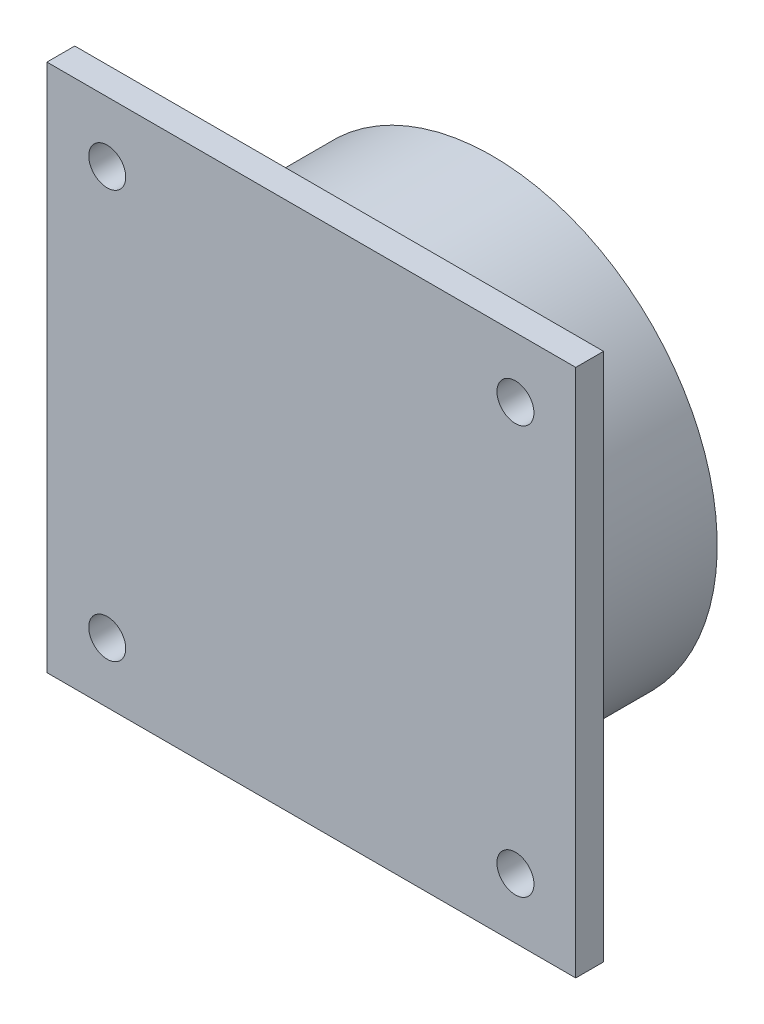
ISO-10303-21;
HEADER;
FILE_DESCRIPTION(('STEP AP214'),'2;1');
FILE_NAME('part.step','',(''),(''),'','','');
FILE_SCHEMA(('AUTOMOTIVE_DESIGN { 1 0 10303 214 1 1 1 1 }'));
ENDSEC;
DATA;
#1=APPLICATION_CONTEXT('core data for automotive mechanical design processes');
#2=APPLICATION_PROTOCOL_DEFINITION('international standard','automotive_design',2000,#1);
#3=PRODUCT_CONTEXT('',#1,'mechanical');
#4=PRODUCT('Part','Part','',(#3));
#5=PRODUCT_RELATED_PRODUCT_CATEGORY('part','',(#4));
#6=PRODUCT_DEFINITION_FORMATION('','',#4);
#7=PRODUCT_DEFINITION_CONTEXT('part definition',#1,'design');
#8=PRODUCT_DEFINITION('design','',#6,#7);
#9=PRODUCT_DEFINITION_SHAPE('','',#8);
#10=(LENGTH_UNIT() NAMED_UNIT(*) SI_UNIT(.MILLI.,.METRE.));
#11=(NAMED_UNIT(*) PLANE_ANGLE_UNIT() SI_UNIT($,.RADIAN.));
#12=(NAMED_UNIT(*) SI_UNIT($,.STERADIAN.) SOLID_ANGLE_UNIT());
#13=UNCERTAINTY_MEASURE_WITH_UNIT(LENGTH_MEASURE(1.E-05),#10,'distance_accuracy_value','');
#14=(GEOMETRIC_REPRESENTATION_CONTEXT(3) GLOBAL_UNCERTAINTY_ASSIGNED_CONTEXT((#13)) GLOBAL_UNIT_ASSIGNED_CONTEXT((#10,
#11,#12)) REPRESENTATION_CONTEXT('',''));
#15=CARTESIAN_POINT('',(0.,0.,0.));
#16=DIRECTION('',(0.,0.,1.));
#17=DIRECTION('',(1.,0.,0.));
#18=AXIS2_PLACEMENT_3D('',#15,#16,#17);
#19=CARTESIAN_POINT('',(-13.908,32.946,3.));
#20=DIRECTION('',(1.,0.,0.));
#21=DIRECTION('',(0.,1.,0.));
#22=AXIS2_PLACEMENT_3D('',#19,#20,#21);
#23=PLANE('',#22);
#24=DIRECTION('',(0.,-1.,0.));
#25=VECTOR('',#24,1.);
#26=CARTESIAN_POINT('',(-13.908,32.946,0.));
#27=LINE('',#26,#25);
#28=CARTESIAN_POINT('',(-13.908,32.946,0.));
#29=VERTEX_POINT('',#28);
#30=CARTESIAN_POINT('',(-13.908,-24.054,0.));
#31=VERTEX_POINT('',#30);
#32=EDGE_CURVE('E115',#29,#31,#27,.T.);
#33=ORIENTED_EDGE('',*,*,#32,.T.);
#34=DIRECTION('',(0.,0.,-1.));
#35=VECTOR('',#34,1.);
#36=CARTESIAN_POINT('',(-13.908,-24.054,3.));
#37=LINE('',#36,#35);
#38=CARTESIAN_POINT('',(-13.908,-24.054,3.));
#39=VERTEX_POINT('',#38);
#40=EDGE_CURVE('E56',#39,#31,#37,.T.);
#41=ORIENTED_EDGE('',*,*,#40,.F.);
#42=DIRECTION('',(0.,-1.,0.));
#43=VECTOR('',#42,1.);
#44=CARTESIAN_POINT('',(-13.908,32.946,3.));
#45=LINE('',#44,#43);
#46=CARTESIAN_POINT('',(-13.908,32.946,3.));
#47=VERTEX_POINT('',#46);
#48=EDGE_CURVE('E101',#47,#39,#45,.T.);
#49=ORIENTED_EDGE('',*,*,#48,.F.);
#50=DIRECTION('',(0.,0.,-1.));
#51=VECTOR('',#50,1.);
#52=CARTESIAN_POINT('',(-13.908,32.946,3.));
#53=LINE('',#52,#51);
#54=EDGE_CURVE('E111',#47,#29,#53,.T.);
#55=ORIENTED_EDGE('',*,*,#54,.T.);
#56=EDGE_LOOP('',(#33,#41,#49,#55));
#57=FACE_BOUND('',#56,.T.);
#58=ADVANCED_FACE('F47',(#57),#23,.F.);
#59=CARTESIAN_POINT('',(-13.908,-24.054,3.));
#60=DIRECTION('',(0.,1.,0.));
#61=DIRECTION('',(0.,0.,1.));
#62=AXIS2_PLACEMENT_3D('',#59,#60,#61);
#63=PLANE('',#62);
#64=DIRECTION('',(1.,0.,0.));
#65=VECTOR('',#64,1.);
#66=CARTESIAN_POINT('',(-13.908,-24.054,0.));
#67=LINE('',#66,#65);
#68=CARTESIAN_POINT('',(43.092,-24.054,0.));
#69=VERTEX_POINT('',#68);
#70=EDGE_CURVE('E106',#31,#69,#67,.T.);
#71=ORIENTED_EDGE('',*,*,#70,.T.);
#72=DIRECTION('',(0.,0.,-1.));
#73=VECTOR('',#72,1.);
#74=CARTESIAN_POINT('',(43.092,-24.054,3.));
#75=LINE('',#74,#73);
#76=CARTESIAN_POINT('',(43.092,-24.054,3.));
#77=VERTEX_POINT('',#76);
#78=EDGE_CURVE('E104',#77,#69,#75,.T.);
#79=ORIENTED_EDGE('',*,*,#78,.F.);
#80=DIRECTION('',(1.,0.,0.));
#81=VECTOR('',#80,1.);
#82=CARTESIAN_POINT('',(-13.908,-24.054,3.));
#83=LINE('',#82,#81);
#84=EDGE_CURVE('E96',#39,#77,#83,.T.);
#85=ORIENTED_EDGE('',*,*,#84,.F.);
#86=ORIENTED_EDGE('',*,*,#40,.T.);
#87=EDGE_LOOP('',(#71,#79,#85,#86));
#88=FACE_BOUND('',#87,.T.);
#89=ADVANCED_FACE('F105',(#88),#63,.F.);
#90=CARTESIAN_POINT('',(43.092,32.946,3.));
#91=DIRECTION('',(-1.,0.,0.));
#92=DIRECTION('',(0.,-1.,0.));
#93=AXIS2_PLACEMENT_3D('',#90,#91,#92);
#94=PLANE('',#93);
#95=DIRECTION('',(0.,1.,0.));
#96=VECTOR('',#95,1.);
#97=CARTESIAN_POINT('',(43.092,32.946,0.));
#98=LINE('',#97,#96);
#99=CARTESIAN_POINT('',(43.092,32.946,0.));
#100=VERTEX_POINT('',#99);
#101=EDGE_CURVE('E82',#69,#100,#98,.T.);
#102=ORIENTED_EDGE('',*,*,#101,.T.);
#103=DIRECTION('',(0.,0.,-1.));
#104=VECTOR('',#103,1.);
#105=CARTESIAN_POINT('',(43.092,32.946,3.));
#106=LINE('',#105,#104);
#107=CARTESIAN_POINT('',(43.092,32.946,3.));
#108=VERTEX_POINT('',#107);
#109=EDGE_CURVE('E107',#108,#100,#106,.T.);
#110=ORIENTED_EDGE('',*,*,#109,.F.);
#111=DIRECTION('',(0.,1.,0.));
#112=VECTOR('',#111,1.);
#113=CARTESIAN_POINT('',(43.092,32.946,3.));
#114=LINE('',#113,#112);
#115=EDGE_CURVE('E99',#77,#108,#114,.T.);
#116=ORIENTED_EDGE('',*,*,#115,.F.);
#117=ORIENTED_EDGE('',*,*,#78,.T.);
#118=EDGE_LOOP('',(#102,#110,#116,#117));
#119=FACE_BOUND('',#118,.T.);
#120=ADVANCED_FACE('F109',(#119),#94,.F.);
#121=CARTESIAN_POINT('',(-13.908,32.946,3.));
#122=DIRECTION('',(0.,-1.,0.));
#123=DIRECTION('',(0.,0.,-1.));
#124=AXIS2_PLACEMENT_3D('',#121,#122,#123);
#125=PLANE('',#124);
#126=DIRECTION('',(-1.,0.,0.));
#127=VECTOR('',#126,1.);
#128=CARTESIAN_POINT('',(-13.908,32.946,0.));
#129=LINE('',#128,#127);
#130=EDGE_CURVE('E88',#100,#29,#129,.T.);
#131=ORIENTED_EDGE('',*,*,#130,.T.);
#132=ORIENTED_EDGE('',*,*,#54,.F.);
#133=DIRECTION('',(-1.,0.,0.));
#134=VECTOR('',#133,1.);
#135=CARTESIAN_POINT('',(-13.908,32.946,3.));
#136=LINE('',#135,#134);
#137=EDGE_CURVE('E65',#108,#47,#136,.T.);
#138=ORIENTED_EDGE('',*,*,#137,.F.);
#139=ORIENTED_EDGE('',*,*,#109,.T.);
#140=EDGE_LOOP('',(#131,#132,#138,#139));
#141=FACE_BOUND('',#140,.T.);
#142=ADVANCED_FACE('F161',(#141),#125,.F.);
#143=CARTESIAN_POINT('',(0.,0.,3.));
#144=DIRECTION('',(0.,0.,1.));
#145=DIRECTION('',(1.,0.,0.));
#146=AXIS2_PLACEMENT_3D('',#143,#144,#145);
#147=PLANE('',#146);
#148=CARTESIAN_POINT('',(-7.40799999999999,26.446,3.));
#149=DIRECTION('',(0.,0.,1.));
#150=DIRECTION('',(1.,0.,0.));
#151=AXIS2_PLACEMENT_3D('',#148,#149,#150);
#152=CIRCLE('',#151,1.9939);
#153=CARTESIAN_POINT('',(-5.41409999999998,26.446,3.));
#154=VERTEX_POINT('',#153);
#155=EDGE_CURVE('E146',#154,#154,#152,.T.);
#156=ORIENTED_EDGE('',*,*,#155,.F.);
#157=EDGE_LOOP('',(#156));
#158=FACE_BOUND('',#157,.T.);
#159=CARTESIAN_POINT('',(-7.408,-17.554,3.));
#160=DIRECTION('',(0.,0.,1.));
#161=DIRECTION('',(1.,0.,0.));
#162=AXIS2_PLACEMENT_3D('',#159,#160,#161);
#163=CIRCLE('',#162,1.9939);
#164=CARTESIAN_POINT('',(-5.4141,-17.554,3.));
#165=VERTEX_POINT('',#164);
#166=EDGE_CURVE('E149',#165,#165,#163,.T.);
#167=ORIENTED_EDGE('',*,*,#166,.F.);
#168=EDGE_LOOP('',(#167));
#169=FACE_BOUND('',#168,.T.);
#170=CARTESIAN_POINT('',(36.592,-17.554,3.));
#171=DIRECTION('',(0.,0.,1.));
#172=DIRECTION('',(1.,0.,0.));
#173=AXIS2_PLACEMENT_3D('',#170,#171,#172);
#174=CIRCLE('',#173,1.9939);
#175=CARTESIAN_POINT('',(38.5859,-17.554,3.));
#176=VERTEX_POINT('',#175);
#177=EDGE_CURVE('E145',#176,#176,#174,.T.);
#178=ORIENTED_EDGE('',*,*,#177,.F.);
#179=EDGE_LOOP('',(#178));
#180=FACE_BOUND('',#179,.T.);
#181=CARTESIAN_POINT('',(36.592,26.446,3.));
#182=DIRECTION('',(0.,0.,1.));
#183=DIRECTION('',(1.,0.,0.));
#184=AXIS2_PLACEMENT_3D('',#181,#182,#183);
#185=CIRCLE('',#184,1.9939);
#186=CARTESIAN_POINT('',(38.5859,26.446,3.));
#187=VERTEX_POINT('',#186);
#188=EDGE_CURVE('E129',#187,#187,#185,.T.);
#189=ORIENTED_EDGE('',*,*,#188,.F.);
#190=EDGE_LOOP('',(#189));
#191=FACE_BOUND('',#190,.T.);
#192=ORIENTED_EDGE('',*,*,#48,.T.);
#193=ORIENTED_EDGE('',*,*,#84,.T.);
#194=ORIENTED_EDGE('',*,*,#115,.T.);
#195=ORIENTED_EDGE('',*,*,#137,.T.);
#196=EDGE_LOOP('',(#192,#193,#194,#195));
#197=FACE_BOUND('',#196,.T.);
#198=ADVANCED_FACE('F97',(#158,#169,#180,#191,#197),#147,.T.);
#199=CARTESIAN_POINT('',(0.,0.,0.));
#200=DIRECTION('',(0.,0.,1.));
#201=DIRECTION('',(1.,0.,0.));
#202=AXIS2_PLACEMENT_3D('',#199,#200,#201);
#203=PLANE('',#202);
#204=CARTESIAN_POINT('',(-7.40799999999999,26.446,0.));
#205=DIRECTION('',(0.,0.,1.));
#206=DIRECTION('',(1.,0.,0.));
#207=AXIS2_PLACEMENT_3D('',#204,#205,#206);
#208=CIRCLE('',#207,1.9939);
#209=CARTESIAN_POINT('',(-5.41409999999998,26.446,0.));
#210=VERTEX_POINT('',#209);
#211=EDGE_CURVE('E50',#210,#210,#208,.T.);
#212=ORIENTED_EDGE('',*,*,#211,.T.);
#213=EDGE_LOOP('',(#212));
#214=FACE_BOUND('',#213,.T.);
#215=CARTESIAN_POINT('',(-7.408,-17.554,0.));
#216=DIRECTION('',(0.,0.,1.));
#217=DIRECTION('',(1.,0.,0.));
#218=AXIS2_PLACEMENT_3D('',#215,#216,#217);
#219=CIRCLE('',#218,1.9939);
#220=CARTESIAN_POINT('',(-5.4141,-17.554,0.));
#221=VERTEX_POINT('',#220);
#222=EDGE_CURVE('E131',#221,#221,#219,.T.);
#223=ORIENTED_EDGE('',*,*,#222,.T.);
#224=EDGE_LOOP('',(#223));
#225=FACE_BOUND('',#224,.T.);
#226=CARTESIAN_POINT('',(36.592,-17.554,0.));
#227=DIRECTION('',(0.,0.,1.));
#228=DIRECTION('',(1.,0.,0.));
#229=AXIS2_PLACEMENT_3D('',#226,#227,#228);
#230=CIRCLE('',#229,1.9939);
#231=CARTESIAN_POINT('',(38.5859,-17.554,0.));
#232=VERTEX_POINT('',#231);
#233=EDGE_CURVE('E128',#232,#232,#230,.T.);
#234=ORIENTED_EDGE('',*,*,#233,.T.);
#235=EDGE_LOOP('',(#234));
#236=FACE_BOUND('',#235,.T.);
#237=CARTESIAN_POINT('',(36.592,26.446,0.));
#238=DIRECTION('',(0.,0.,1.));
#239=DIRECTION('',(1.,0.,0.));
#240=AXIS2_PLACEMENT_3D('',#237,#238,#239);
#241=CIRCLE('',#240,1.9939);
#242=CARTESIAN_POINT('',(38.5859,26.446,0.));
#243=VERTEX_POINT('',#242);
#244=EDGE_CURVE('E125',#243,#243,#241,.T.);
#245=ORIENTED_EDGE('',*,*,#244,.T.);
#246=EDGE_LOOP('',(#245));
#247=FACE_BOUND('',#246,.T.);
#248=CARTESIAN_POINT('',(14.592,4.44600000000001,0.));
#249=DIRECTION('',(0.,0.,-1.));
#250=DIRECTION('',(-1.,0.,0.));
#251=AXIS2_PLACEMENT_3D('',#248,#249,#250);
#252=CIRCLE('',#251,24.25);
#253=CARTESIAN_POINT('',(-9.658,4.44600000000001,0.));
#254=VERTEX_POINT('',#253);
#255=EDGE_CURVE('E13',#254,#254,#252,.T.);
#256=ORIENTED_EDGE('',*,*,#255,.F.);
#257=EDGE_LOOP('',(#256));
#258=FACE_BOUND('',#257,.T.);
#259=ORIENTED_EDGE('',*,*,#32,.F.);
#260=ORIENTED_EDGE('',*,*,#130,.F.);
#261=ORIENTED_EDGE('',*,*,#101,.F.);
#262=ORIENTED_EDGE('',*,*,#70,.F.);
#263=EDGE_LOOP('',(#259,#260,#261,#262));
#264=FACE_BOUND('',#263,.T.);
#265=ADVANCED_FACE('F160',(#214,#225,#236,#247,#258,#264),#203,.F.);
#266=CARTESIAN_POINT('',(14.592,4.44600000000001,-16.5));
#267=DIRECTION('',(0.,0.,1.));
#268=DIRECTION('',(1.,0.,0.));
#269=AXIS2_PLACEMENT_3D('',#266,#267,#268);
#270=CYLINDRICAL_SURFACE('',#269,24.25);
#271=CARTESIAN_POINT('',(14.592,4.44600000000001,-16.5));
#272=DIRECTION('',(0.,0.,-1.));
#273=DIRECTION('',(-1.,0.,0.));
#274=AXIS2_PLACEMENT_3D('',#271,#272,#273);
#275=CIRCLE('',#274,24.25);
#276=CARTESIAN_POINT('',(-9.658,4.44600000000001,-16.5));
#277=VERTEX_POINT('',#276);
#278=EDGE_CURVE('E118',#277,#277,#275,.T.);
#279=ORIENTED_EDGE('',*,*,#278,.F.);
#280=EDGE_LOOP('',(#279));
#281=FACE_BOUND('',#280,.T.);
#282=ORIENTED_EDGE('',*,*,#255,.T.);
#283=EDGE_LOOP('',(#282));
#284=FACE_BOUND('',#283,.T.);
#285=ADVANCED_FACE('F175',(#281,#284),#270,.T.);
#286=CARTESIAN_POINT('',(14.592,4.44600000000001,-16.5));
#287=DIRECTION('',(0.,0.,-1.));
#288=DIRECTION('',(-1.,0.,0.));
#289=AXIS2_PLACEMENT_3D('',#286,#287,#288);
#290=PLANE('',#289);
#291=ORIENTED_EDGE('',*,*,#278,.T.);
#292=EDGE_LOOP('',(#291));
#293=FACE_BOUND('',#292,.T.);
#294=ADVANCED_FACE('F169',(#293),#290,.T.);
#295=CARTESIAN_POINT('',(36.592,26.446,-13.5));
#296=DIRECTION('',(0.,0.,1.));
#297=DIRECTION('',(1.,0.,0.));
#298=AXIS2_PLACEMENT_3D('',#295,#296,#297);
#299=CYLINDRICAL_SURFACE('',#298,1.9939);
#300=ORIENTED_EDGE('',*,*,#188,.T.);
#301=EDGE_LOOP('',(#300));
#302=FACE_BOUND('',#301,.T.);
#303=ORIENTED_EDGE('',*,*,#244,.F.);
#304=EDGE_LOOP('',(#303));
#305=FACE_BOUND('',#304,.T.);
#306=ADVANCED_FACE('F166',(#302,#305),#299,.F.);
#307=CARTESIAN_POINT('',(36.592,-17.554,-13.5));
#308=DIRECTION('',(0.,0.,1.));
#309=DIRECTION('',(1.,0.,0.));
#310=AXIS2_PLACEMENT_3D('',#307,#308,#309);
#311=CYLINDRICAL_SURFACE('',#310,1.9939);
#312=ORIENTED_EDGE('',*,*,#177,.T.);
#313=EDGE_LOOP('',(#312));
#314=FACE_BOUND('',#313,.T.);
#315=ORIENTED_EDGE('',*,*,#233,.F.);
#316=EDGE_LOOP('',(#315));
#317=FACE_BOUND('',#316,.T.);
#318=ADVANCED_FACE('F155',(#314,#317),#311,.F.);
#319=CARTESIAN_POINT('',(-7.408,-17.554,-13.5));
#320=DIRECTION('',(0.,0.,1.));
#321=DIRECTION('',(1.,0.,0.));
#322=AXIS2_PLACEMENT_3D('',#319,#320,#321);
#323=CYLINDRICAL_SURFACE('',#322,1.9939);
#324=ORIENTED_EDGE('',*,*,#166,.T.);
#325=EDGE_LOOP('',(#324));
#326=FACE_BOUND('',#325,.T.);
#327=ORIENTED_EDGE('',*,*,#222,.F.);
#328=EDGE_LOOP('',(#327));
#329=FACE_BOUND('',#328,.T.);
#330=ADVANCED_FACE('F245',(#326,#329),#323,.F.);
#331=CARTESIAN_POINT('',(-7.40799999999999,26.446,-13.5));
#332=DIRECTION('',(0.,0.,1.));
#333=DIRECTION('',(1.,0.,0.));
#334=AXIS2_PLACEMENT_3D('',#331,#332,#333);
#335=CYLINDRICAL_SURFACE('',#334,1.9939);
#336=ORIENTED_EDGE('',*,*,#155,.T.);
#337=EDGE_LOOP('',(#336));
#338=FACE_BOUND('',#337,.T.);
#339=ORIENTED_EDGE('',*,*,#211,.F.);
#340=EDGE_LOOP('',(#339));
#341=FACE_BOUND('',#340,.T.);
#342=ADVANCED_FACE('F254',(#338,#341),#335,.F.);
#343=CLOSED_SHELL('',(#58,#89,#120,#142,#198,#265,#285,#294,#306,#318,#330,#342));
#344=MANIFOLD_SOLID_BREP('B2',#343);
#345=ADVANCED_BREP_SHAPE_REPRESENTATION('',(#18,#344),#14);
#346=SHAPE_DEFINITION_REPRESENTATION(#9,#345);
ENDSEC;
END-ISO-10303-21;
